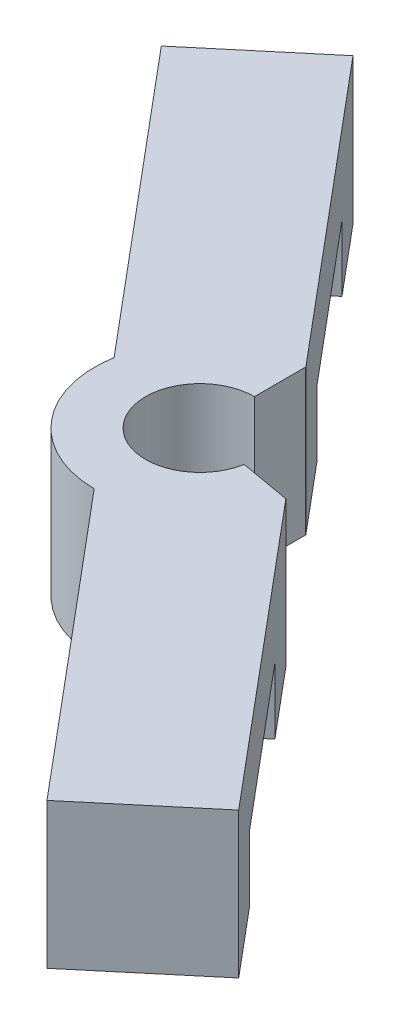
ISO-10303-21;
HEADER;
FILE_DESCRIPTION(('STEP AP214'),'2;1');
FILE_NAME('part.step','',(''),(''),'','','');
FILE_SCHEMA(('AUTOMOTIVE_DESIGN { 1 0 10303 214 1 1 1 1 }'));
ENDSEC;
DATA;
#1=APPLICATION_CONTEXT('core data for automotive mechanical design processes');
#2=APPLICATION_PROTOCOL_DEFINITION('international standard','automotive_design',2000,#1);
#3=PRODUCT_CONTEXT('',#1,'mechanical');
#4=PRODUCT('Part','Part','',(#3));
#5=PRODUCT_RELATED_PRODUCT_CATEGORY('part','',(#4));
#6=PRODUCT_DEFINITION_FORMATION('','',#4);
#7=PRODUCT_DEFINITION_CONTEXT('part definition',#1,'design');
#8=PRODUCT_DEFINITION('design','',#6,#7);
#9=PRODUCT_DEFINITION_SHAPE('','',#8);
#10=(LENGTH_UNIT() NAMED_UNIT(*) SI_UNIT(.MILLI.,.METRE.));
#11=(NAMED_UNIT(*) PLANE_ANGLE_UNIT() SI_UNIT($,.RADIAN.));
#12=(NAMED_UNIT(*) SI_UNIT($,.STERADIAN.) SOLID_ANGLE_UNIT());
#13=UNCERTAINTY_MEASURE_WITH_UNIT(LENGTH_MEASURE(1.E-05),#10,'distance_accuracy_value','');
#14=(GEOMETRIC_REPRESENTATION_CONTEXT(3) GLOBAL_UNCERTAINTY_ASSIGNED_CONTEXT((#13)) GLOBAL_UNIT_ASSIGNED_CONTEXT((#10,
#11,#12)) REPRESENTATION_CONTEXT('',''));
#15=CARTESIAN_POINT('',(0.,0.,0.));
#16=DIRECTION('',(0.,0.,1.));
#17=DIRECTION('',(1.,0.,0.));
#18=AXIS2_PLACEMENT_3D('',#15,#16,#17);
#19=CARTESIAN_POINT('',(0.,0.,0.));
#20=DIRECTION('',(0.,1.,0.));
#21=DIRECTION('',(0.,0.,1.));
#22=AXIS2_PLACEMENT_3D('',#19,#20,#21);
#23=PLANE('',#22);
#24=DIRECTION('',(-0.642787609686538,0.,-0.766044443118979));
#25=VECTOR('',#24,1.);
#26=CARTESIAN_POINT('',(3.06417777247595,0.,-2.57115043874618));
#27=LINE('',#26,#25);
#28=CARTESIAN_POINT('',(-11.0771496406279,0.,-19.4241281873637));
#29=VERTEX_POINT('',#28);
#30=CARTESIAN_POINT('',(-14.460084449623,0.,-23.4557528994956));
#31=VERTEX_POINT('',#30);
#32=EDGE_CURVE('E316',#29,#31,#27,.T.);
#33=ORIENTED_EDGE('',*,*,#32,.F.);
#34=DIRECTION('',(-0.766044443118979,0.,0.642787609686538));
#35=VECTOR('',#34,1.);
#36=CARTESIAN_POINT('',(-14.1413274131038,0.,-16.8529777486175));
#37=LINE('',#36,#35);
#38=CARTESIAN_POINT('',(-17.2055051855797,0.,-14.2818273098714));
#39=VERTEX_POINT('',#38);
#40=EDGE_CURVE('E11',#29,#39,#37,.T.);
#41=ORIENTED_EDGE('',*,*,#40,.T.);
#42=DIRECTION('',(-0.642787609686538,0.,-0.766044443118979));
#43=VECTOR('',#42,1.);
#44=CARTESIAN_POINT('',(-3.06417777247588,0.,2.57115043874612));
#45=LINE('',#44,#43);
#46=CARTESIAN_POINT('',(-20.5884399945748,0.,-18.3134520220033));
#47=VERTEX_POINT('',#46);
#48=EDGE_CURVE('E207',#39,#47,#45,.T.);
#49=ORIENTED_EDGE('',*,*,#48,.T.);
#50=DIRECTION('',(0.766044443118979,0.,-0.642787609686538));
#51=VECTOR('',#50,1.);
#52=CARTESIAN_POINT('',(-17.5242622220989,0.,-20.8846024607495));
#53=LINE('',#52,#51);
#54=EDGE_CURVE('E213',#47,#31,#53,.T.);
#55=ORIENTED_EDGE('',*,*,#54,.T.);
#56=EDGE_LOOP('',(#33,#41,#49,#55));
#57=FACE_BOUND('',#56,.T.);
#58=ADVANCED_FACE('F45',(#57),#23,.F.);
#59=DIRECTION('',(0.642787609686538,0.,0.766044443118979));
#60=VECTOR('',#59,1.);
#61=CARTESIAN_POINT('',(-3.06417777247588,0.,2.57115043874612));
#62=LINE('',#61,#60);
#63=CARTESIAN_POINT('',(11.077149640628,0.,19.4241281873637));
#64=VERTEX_POINT('',#63);
#65=CARTESIAN_POINT('',(14.460084449623,0.,23.4557528994956));
#66=VERTEX_POINT('',#65);
#67=EDGE_CURVE('E211',#64,#66,#62,.T.);
#68=ORIENTED_EDGE('',*,*,#67,.F.);
#69=DIRECTION('',(0.766044443118979,0.,-0.642787609686538));
#70=VECTOR('',#69,1.);
#71=CARTESIAN_POINT('',(14.1413274131038,0.,16.8529777486175));
#72=LINE('',#71,#70);
#73=CARTESIAN_POINT('',(17.2055051855798,0.,14.2818273098714));
#74=VERTEX_POINT('',#73);
#75=EDGE_CURVE('E191',#64,#74,#72,.T.);
#76=ORIENTED_EDGE('',*,*,#75,.T.);
#77=DIRECTION('',(0.642787609686538,0.,0.766044443118979));
#78=VECTOR('',#77,1.);
#79=CARTESIAN_POINT('',(3.06417777247595,0.,-2.57115043874618));
#80=LINE('',#79,#78);
#81=CARTESIAN_POINT('',(20.5884399945749,0.,18.3134520220033));
#82=VERTEX_POINT('',#81);
#83=EDGE_CURVE('E274',#74,#82,#80,.T.);
#84=ORIENTED_EDGE('',*,*,#83,.T.);
#85=DIRECTION('',(0.766044443118979,0.,-0.642787609686538));
#86=VECTOR('',#85,1.);
#87=CARTESIAN_POINT('',(17.5242622220989,0.,20.8846024607495));
#88=LINE('',#87,#86);
#89=EDGE_CURVE('E288',#66,#82,#88,.T.);
#90=ORIENTED_EDGE('',*,*,#89,.F.);
#91=EDGE_LOOP('',(#68,#76,#84,#90));
#92=FACE_BOUND('',#91,.T.);
#93=ADVANCED_FACE('F272',(#92),#23,.F.);
#94=CARTESIAN_POINT('',(17.5242622220989,8.55,20.8846024607495));
#95=DIRECTION('',(-0.642787609686538,0.,-0.766044443118979));
#96=DIRECTION('',(-0.76604444311898,0.,0.642787609686538));
#97=AXIS2_PLACEMENT_3D('',#94,#95,#96);
#98=PLANE('',#97);
#99=ORIENTED_EDGE('',*,*,#89,.T.);
#100=DIRECTION('',(0.,-1.,0.));
#101=VECTOR('',#100,1.);
#102=CARTESIAN_POINT('',(20.5884399945749,8.55,18.3134520220033));
#103=LINE('',#102,#101);
#104=CARTESIAN_POINT('',(20.5884399945749,8.55,18.3134520220033));
#105=VERTEX_POINT('',#104);
#106=EDGE_CURVE('E260',#105,#82,#103,.T.);
#107=ORIENTED_EDGE('',*,*,#106,.F.);
#108=DIRECTION('',(0.766044443118979,0.,-0.642787609686538));
#109=VECTOR('',#108,1.);
#110=CARTESIAN_POINT('',(17.5242622220989,8.55,20.8846024607495));
#111=LINE('',#110,#109);
#112=CARTESIAN_POINT('',(14.460084449623,8.55,23.4557528994956));
#113=VERTEX_POINT('',#112);
#114=EDGE_CURVE('E221',#113,#105,#111,.T.);
#115=ORIENTED_EDGE('',*,*,#114,.F.);
#116=DIRECTION('',(0.,-1.,0.));
#117=VECTOR('',#116,1.);
#118=CARTESIAN_POINT('',(14.460084449623,8.55,23.4557528994956));
#119=LINE('',#118,#117);
#120=EDGE_CURVE('E222',#113,#66,#119,.T.);
#121=ORIENTED_EDGE('',*,*,#120,.T.);
#122=EDGE_LOOP('',(#99,#107,#115,#121));
#123=FACE_BOUND('',#122,.T.);
#124=ADVANCED_FACE('F47',(#123),#98,.F.);
#125=CARTESIAN_POINT('',(3.06417777247595,8.55,-2.57115043874618));
#126=DIRECTION('',(0.766044443118979,0.,-0.642787609686538));
#127=DIRECTION('',(-0.642787609686538,0.,-0.766044443118979));
#128=AXIS2_PLACEMENT_3D('',#125,#126,#127);
#129=PLANE('',#128);
#130=DIRECTION('',(0.,-1.,0.));
#131=VECTOR('',#130,1.);
#132=CARTESIAN_POINT('',(17.2055051855798,8.55,14.2818273098714));
#133=LINE('',#132,#131);
#134=CARTESIAN_POINT('',(17.2055051855798,3.87239923594268,14.2818273098714));
#135=VERTEX_POINT('',#134);
#136=EDGE_CURVE('E282',#135,#74,#133,.T.);
#137=ORIENTED_EDGE('',*,*,#136,.F.);
#138=DIRECTION('',(0.642787609686538,0.,0.766044443118979));
#139=VECTOR('',#138,1.);
#140=CARTESIAN_POINT('',(3.06417777247595,3.87239923594268,-2.57115043874618));
#141=LINE('',#140,#139);
#142=CARTESIAN_POINT('',(9.49205386934132,3.87239923594268,5.08929399244361));
#143=VERTEX_POINT('',#142);
#144=EDGE_CURVE('E414',#143,#135,#141,.T.);
#145=ORIENTED_EDGE('',*,*,#144,.F.);
#146=DIRECTION('',(0.,1.,0.));
#147=VECTOR('',#146,1.);
#148=CARTESIAN_POINT('',(9.49205386934133,8.55,5.08929399244361));
#149=LINE('',#148,#147);
#150=CARTESIAN_POINT('',(9.49205386934133,0.,5.08929399244361));
#151=VERTEX_POINT('',#150);
#152=EDGE_CURVE('E413',#151,#143,#149,.T.);
#153=ORIENTED_EDGE('',*,*,#152,.F.);
#154=CARTESIAN_POINT('',(6.10911906034624,0.,1.05766928031169));
#155=VERTEX_POINT('',#154);
#156=EDGE_CURVE('E287',#155,#151,#80,.T.);
#157=ORIENTED_EDGE('',*,*,#156,.F.);
#158=DIRECTION('',(0.,-1.,0.));
#159=VECTOR('',#158,1.);
#160=CARTESIAN_POINT('',(6.10911906034624,8.55,1.05766928031169));
#161=LINE('',#160,#159);
#162=CARTESIAN_POINT('',(6.10911906034624,8.55,1.05766928031169));
#163=VERTEX_POINT('',#162);
#164=EDGE_CURVE('E257',#163,#155,#161,.T.);
#165=ORIENTED_EDGE('',*,*,#164,.F.);
#166=DIRECTION('',(0.642787609686538,0.,0.766044443118979));
#167=VECTOR('',#166,1.);
#168=CARTESIAN_POINT('',(3.06417777247595,8.55,-2.57115043874618));
#169=LINE('',#168,#167);
#170=EDGE_CURVE('E368',#163,#105,#169,.T.);
#171=ORIENTED_EDGE('',*,*,#170,.T.);
#172=ORIENTED_EDGE('',*,*,#106,.T.);
#173=ORIENTED_EDGE('',*,*,#83,.F.);
#174=EDGE_LOOP('',(#137,#145,#153,#157,#165,#171,#172,#173));
#175=FACE_BOUND('',#174,.T.);
#176=ADVANCED_FACE('F280',(#175),#129,.T.);
#177=CARTESIAN_POINT('',(0.,8.55,0.));
#178=DIRECTION('',(0.,-1.,0.));
#179=DIRECTION('',(0.,0.,-1.));
#180=AXIS2_PLACEMENT_3D('',#177,#178,#179);
#181=CYLINDRICAL_SURFACE('',#180,6.2);
#182=CARTESIAN_POINT('',(0.,0.,0.));
#183=DIRECTION('',(0.,1.,0.));
#184=DIRECTION('',(0.,0.,1.));
#185=AXIS2_PLACEMENT_3D('',#182,#183,#184);
#186=CIRCLE('',#185,6.2);
#187=CARTESIAN_POINT('',(6.10580806867569,0.,1.07661870153499));
#188=VERTEX_POINT('',#187);
#189=EDGE_CURVE('E293',#188,#155,#186,.T.);
#190=ORIENTED_EDGE('',*,*,#189,.F.);
#191=DIRECTION('',(0.,-1.,0.));
#192=VECTOR('',#191,1.);
#193=CARTESIAN_POINT('',(6.10580806867569,8.55,1.07661870153499));
#194=LINE('',#193,#192);
#195=CARTESIAN_POINT('',(6.10580806867569,8.55,1.07661870153499));
#196=VERTEX_POINT('',#195);
#197=EDGE_CURVE('E254',#196,#188,#194,.T.);
#198=ORIENTED_EDGE('',*,*,#197,.F.);
#199=CARTESIAN_POINT('',(0.,8.55,0.));
#200=DIRECTION('',(0.,1.,0.));
#201=DIRECTION('',(0.,0.,1.));
#202=AXIS2_PLACEMENT_3D('',#199,#200,#201);
#203=CIRCLE('',#202,6.2);
#204=EDGE_CURVE('E371',#196,#163,#203,.T.);
#205=ORIENTED_EDGE('',*,*,#204,.T.);
#206=ORIENTED_EDGE('',*,*,#164,.T.);
#207=EDGE_LOOP('',(#190,#198,#205,#206));
#208=FACE_BOUND('',#207,.T.);
#209=ADVANCED_FACE('F410',(#208),#181,.F.);
#210=CARTESIAN_POINT('',(0.,8.55,0.));
#211=DIRECTION('',(0.173648177666934,0.,-0.984807753012208));
#212=DIRECTION('',(-0.984807753012207,0.,-0.173648177666934));
#213=AXIS2_PLACEMENT_3D('',#210,#211,#212);
#214=PLANE('',#213);
#215=DIRECTION('',(0.984807753012208,0.,0.173648177666934));
#216=VECTOR('',#215,1.);
#217=CARTESIAN_POINT('',(0.,0.,0.));
#218=LINE('',#217,#216);
#219=CARTESIAN_POINT('',(3.15138480963906,0.,0.55567416853419));
#220=VERTEX_POINT('',#219);
#221=EDGE_CURVE('E301',#220,#188,#218,.T.);
#222=ORIENTED_EDGE('',*,*,#221,.F.);
#223=DIRECTION('',(0.,-1.,0.));
#224=VECTOR('',#223,1.);
#225=CARTESIAN_POINT('',(3.15138480963906,8.55,0.55567416853419));
#226=LINE('',#225,#224);
#227=CARTESIAN_POINT('',(3.15138480963906,8.55,0.55567416853419));
#228=VERTEX_POINT('',#227);
#229=EDGE_CURVE('E251',#228,#220,#226,.T.);
#230=ORIENTED_EDGE('',*,*,#229,.F.);
#231=DIRECTION('',(0.984807753012208,0.,0.173648177666934));
#232=VECTOR('',#231,1.);
#233=CARTESIAN_POINT('',(0.,8.55,0.));
#234=LINE('',#233,#232);
#235=EDGE_CURVE('E379',#228,#196,#234,.T.);
#236=ORIENTED_EDGE('',*,*,#235,.T.);
#237=ORIENTED_EDGE('',*,*,#197,.T.);
#238=EDGE_LOOP('',(#222,#230,#236,#237));
#239=FACE_BOUND('',#238,.T.);
#240=ADVANCED_FACE('F406',(#239),#214,.T.);
#241=CARTESIAN_POINT('',(0.,8.55,0.));
#242=DIRECTION('',(0.,-1.,0.));
#243=DIRECTION('',(0.,0.,-1.));
#244=AXIS2_PLACEMENT_3D('',#241,#242,#243);
#245=CYLINDRICAL_SURFACE('',#244,3.2);
#246=CARTESIAN_POINT('',(0.,0.,0.));
#247=DIRECTION('',(0.,1.,0.));
#248=DIRECTION('',(0.,0.,1.));
#249=AXIS2_PLACEMENT_3D('',#246,#247,#248);
#250=CIRCLE('',#249,3.2);
#251=CARTESIAN_POINT('',(0.,0.,-3.2));
#252=VERTEX_POINT('',#251);
#253=EDGE_CURVE('E305',#252,#220,#250,.T.);
#254=ORIENTED_EDGE('',*,*,#253,.F.);
#255=DIRECTION('',(0.,-1.,0.));
#256=VECTOR('',#255,1.);
#257=CARTESIAN_POINT('',(0.,8.55,-3.2));
#258=LINE('',#257,#256);
#259=CARTESIAN_POINT('',(0.,8.55,-3.2));
#260=VERTEX_POINT('',#259);
#261=EDGE_CURVE('E248',#260,#252,#258,.T.);
#262=ORIENTED_EDGE('',*,*,#261,.F.);
#263=CARTESIAN_POINT('',(0.,8.55,0.));
#264=DIRECTION('',(0.,1.,0.));
#265=DIRECTION('',(0.,0.,1.));
#266=AXIS2_PLACEMENT_3D('',#263,#264,#265);
#267=CIRCLE('',#266,3.2);
#268=EDGE_CURVE('E383',#260,#228,#267,.T.);
#269=ORIENTED_EDGE('',*,*,#268,.T.);
#270=ORIENTED_EDGE('',*,*,#229,.T.);
#271=EDGE_LOOP('',(#254,#262,#269,#270));
#272=FACE_BOUND('',#271,.T.);
#273=ADVANCED_FACE('F403',(#272),#245,.F.);
#274=CARTESIAN_POINT('',(0.,8.55,0.));
#275=DIRECTION('',(-1.,0.,0.));
#276=DIRECTION('',(0.,0.,1.));
#277=AXIS2_PLACEMENT_3D('',#274,#275,#276);
#278=PLANE('',#277);
#279=DIRECTION('',(0.,0.,-1.));
#280=VECTOR('',#279,1.);
#281=CARTESIAN_POINT('',(0.,0.,0.));
#282=LINE('',#281,#280);
#283=CARTESIAN_POINT('',(0.,0.,-6.2));
#284=VERTEX_POINT('',#283);
#285=EDGE_CURVE('E309',#252,#284,#282,.T.);
#286=ORIENTED_EDGE('',*,*,#285,.T.);
#287=DIRECTION('',(0.,-1.,0.));
#288=VECTOR('',#287,1.);
#289=CARTESIAN_POINT('',(0.,8.55,-6.2));
#290=LINE('',#289,#288);
#291=CARTESIAN_POINT('',(0.,8.55,-6.2));
#292=VERTEX_POINT('',#291);
#293=EDGE_CURVE('E245',#292,#284,#290,.T.);
#294=ORIENTED_EDGE('',*,*,#293,.F.);
#295=DIRECTION('',(0.,0.,-1.));
#296=VECTOR('',#295,1.);
#297=CARTESIAN_POINT('',(0.,8.55,0.));
#298=LINE('',#297,#296);
#299=EDGE_CURVE('E387',#260,#292,#298,.T.);
#300=ORIENTED_EDGE('',*,*,#299,.F.);
#301=ORIENTED_EDGE('',*,*,#261,.T.);
#302=EDGE_LOOP('',(#286,#294,#300,#301));
#303=FACE_BOUND('',#302,.T.);
#304=ADVANCED_FACE('F399',(#303),#278,.F.);
#305=CARTESIAN_POINT('',(0.,8.55,0.));
#306=DIRECTION('',(0.,-1.,0.));
#307=DIRECTION('',(0.,0.,-1.));
#308=AXIS2_PLACEMENT_3D('',#305,#306,#307);
#309=CYLINDRICAL_SURFACE('',#308,6.2);
#310=CARTESIAN_POINT('',(0.,0.,0.));
#311=DIRECTION('',(0.,1.,0.));
#312=DIRECTION('',(0.,0.,1.));
#313=AXIS2_PLACEMENT_3D('',#310,#311,#312);
#314=CIRCLE('',#313,6.2);
#315=CARTESIAN_POINT('',(0.0192364846056626,0.,-6.19997015780405));
#316=VERTEX_POINT('',#315);
#317=EDGE_CURVE('E313',#316,#284,#314,.T.);
#318=ORIENTED_EDGE('',*,*,#317,.F.);
#319=DIRECTION('',(0.,-1.,0.));
#320=VECTOR('',#319,1.);
#321=CARTESIAN_POINT('',(0.0192364846056626,8.55,-6.19997015780405));
#322=LINE('',#321,#320);
#323=CARTESIAN_POINT('',(0.0192364846056626,8.55,-6.19997015780405));
#324=VERTEX_POINT('',#323);
#325=EDGE_CURVE('E242',#324,#316,#322,.T.);
#326=ORIENTED_EDGE('',*,*,#325,.F.);
#327=CARTESIAN_POINT('',(0.,8.55,0.));
#328=DIRECTION('',(0.,1.,0.));
#329=DIRECTION('',(0.,0.,1.));
#330=AXIS2_PLACEMENT_3D('',#327,#328,#329);
#331=CIRCLE('',#330,6.2);
#332=EDGE_CURVE('E351',#324,#292,#331,.T.);
#333=ORIENTED_EDGE('',*,*,#332,.T.);
#334=ORIENTED_EDGE('',*,*,#293,.T.);
#335=EDGE_LOOP('',(#318,#326,#333,#334));
#336=FACE_BOUND('',#335,.T.);
#337=ADVANCED_FACE('F393',(#336),#309,.F.);
#338=CARTESIAN_POINT('',(3.06417777247595,8.55,-2.57115043874618));
#339=DIRECTION('',(-0.766044443118979,0.,0.642787609686538));
#340=DIRECTION('',(0.642787609686538,0.,0.766044443118979));
#341=AXIS2_PLACEMENT_3D('',#338,#339,#340);
#342=PLANE('',#341);
#343=DIRECTION('',(-0.642787609686538,0.,-0.766044443118979));
#344=VECTOR('',#343,1.);
#345=CARTESIAN_POINT('',(3.06417777247595,3.87239923594268,-2.57115043874618));
#346=LINE('',#345,#344);
#347=CARTESIAN_POINT('',(-3.36369832438943,3.87239923594268,-10.231594869936));
#348=VERTEX_POINT('',#347);
#349=CARTESIAN_POINT('',(-11.0771496406279,3.87239923594268,-19.4241281873637));
#350=VERTEX_POINT('',#349);
#351=EDGE_CURVE('E294',#348,#350,#346,.T.);
#352=ORIENTED_EDGE('',*,*,#351,.T.);
#353=DIRECTION('',(0.,-1.,0.));
#354=VECTOR('',#353,1.);
#355=CARTESIAN_POINT('',(-11.0771496406279,8.55,-19.4241281873637));
#356=LINE('',#355,#354);
#357=EDGE_CURVE('E330',#350,#29,#356,.T.);
#358=ORIENTED_EDGE('',*,*,#357,.T.);
#359=ORIENTED_EDGE('',*,*,#32,.T.);
#360=DIRECTION('',(0.,-1.,0.));
#361=VECTOR('',#360,1.);
#362=CARTESIAN_POINT('',(-14.460084449623,8.55,-23.4557528994956));
#363=LINE('',#362,#361);
#364=CARTESIAN_POINT('',(-14.460084449623,8.55,-23.4557528994956));
#365=VERTEX_POINT('',#364);
#366=EDGE_CURVE('E238',#365,#31,#363,.T.);
#367=ORIENTED_EDGE('',*,*,#366,.F.);
#368=DIRECTION('',(-0.642787609686538,0.,-0.766044443118979));
#369=VECTOR('',#368,1.);
#370=CARTESIAN_POINT('',(3.06417777247595,8.55,-2.57115043874618));
#371=LINE('',#370,#369);
#372=EDGE_CURVE('E344',#324,#365,#371,.T.);
#373=ORIENTED_EDGE('',*,*,#372,.F.);
#374=ORIENTED_EDGE('',*,*,#325,.T.);
#375=CARTESIAN_POINT('',(-3.36369832438943,0.,-10.231594869936));
#376=VERTEX_POINT('',#375);
#377=EDGE_CURVE('E317',#316,#376,#27,.T.);
#378=ORIENTED_EDGE('',*,*,#377,.T.);
#379=DIRECTION('',(0.,1.,0.));
#380=VECTOR('',#379,1.);
#381=CARTESIAN_POINT('',(-3.36369832438943,8.55,-10.231594869936));
#382=LINE('',#381,#380);
#383=EDGE_CURVE('E61',#376,#348,#382,.T.);
#384=ORIENTED_EDGE('',*,*,#383,.T.);
#385=EDGE_LOOP('',(#352,#358,#359,#367,#373,#374,#378,#384));
#386=FACE_BOUND('',#385,.T.);
#387=ADVANCED_FACE('F327',(#386),#342,.F.);
#388=CARTESIAN_POINT('',(-17.5242622220989,8.55,-20.8846024607495));
#389=DIRECTION('',(-0.642787609686538,0.,-0.766044443118979));
#390=DIRECTION('',(-0.766044443118979,0.,0.642787609686538));
#391=AXIS2_PLACEMENT_3D('',#388,#389,#390);
#392=PLANE('',#391);
#393=ORIENTED_EDGE('',*,*,#54,.F.);
#394=DIRECTION('',(0.,-1.,0.));
#395=VECTOR('',#394,1.);
#396=CARTESIAN_POINT('',(-20.5884399945748,8.55,-18.3134520220033));
#397=LINE('',#396,#395);
#398=CARTESIAN_POINT('',(-20.5884399945748,8.55,-18.3134520220033));
#399=VERTEX_POINT('',#398);
#400=EDGE_CURVE('E234',#399,#47,#397,.T.);
#401=ORIENTED_EDGE('',*,*,#400,.F.);
#402=DIRECTION('',(0.766044443118979,0.,-0.642787609686538));
#403=VECTOR('',#402,1.);
#404=CARTESIAN_POINT('',(-17.5242622220989,8.55,-20.8846024607495));
#405=LINE('',#404,#403);
#406=EDGE_CURVE('E336',#399,#365,#405,.T.);
#407=ORIENTED_EDGE('',*,*,#406,.T.);
#408=ORIENTED_EDGE('',*,*,#366,.T.);
#409=EDGE_LOOP('',(#393,#401,#407,#408));
#410=FACE_BOUND('',#409,.T.);
#411=ADVANCED_FACE('F334',(#410),#392,.T.);
#412=CARTESIAN_POINT('',(-3.06417777247588,8.55,2.57115043874612));
#413=DIRECTION('',(-0.766044443118979,0.,0.642787609686538));
#414=DIRECTION('',(0.642787609686538,0.,0.766044443118979));
#415=AXIS2_PLACEMENT_3D('',#412,#413,#414);
#416=PLANE('',#415);
#417=DIRECTION('',(0.,-1.,0.));
#418=VECTOR('',#417,1.);
#419=CARTESIAN_POINT('',(-17.2055051855797,0.,-14.2818273098714));
#420=LINE('',#419,#418);
#421=CARTESIAN_POINT('',(-17.2055051855797,3.87239923594268,-14.2818273098714));
#422=VERTEX_POINT('',#421);
#423=EDGE_CURVE('E438',#422,#39,#420,.T.);
#424=ORIENTED_EDGE('',*,*,#423,.F.);
#425=DIRECTION('',(-0.642787609686538,0.,-0.766044443118979));
#426=VECTOR('',#425,1.);
#427=CARTESIAN_POINT('',(-17.2055051855797,3.87239923594268,-14.2818273098714));
#428=LINE('',#427,#426);
#429=CARTESIAN_POINT('',(-9.49205386934126,3.87239923594268,-5.08929399244367));
#430=VERTEX_POINT('',#429);
#431=EDGE_CURVE('E198',#430,#422,#428,.T.);
#432=ORIENTED_EDGE('',*,*,#431,.F.);
#433=DIRECTION('',(0.,1.,0.));
#434=VECTOR('',#433,1.);
#435=CARTESIAN_POINT('',(-9.49205386934126,3.87239923594268,-5.08929399244367));
#436=LINE('',#435,#434);
#437=CARTESIAN_POINT('',(-9.49205386934126,0.,-5.08929399244367));
#438=VERTEX_POINT('',#437);
#439=EDGE_CURVE('E184',#438,#430,#436,.T.);
#440=ORIENTED_EDGE('',*,*,#439,.F.);
#441=CARTESIAN_POINT('',(-6.10911906034617,0.,-1.05766928031175));
#442=VERTEX_POINT('',#441);
#443=EDGE_CURVE('E196',#442,#438,#45,.T.);
#444=ORIENTED_EDGE('',*,*,#443,.F.);
#445=DIRECTION('',(0.,-1.,0.));
#446=VECTOR('',#445,1.);
#447=CARTESIAN_POINT('',(-6.10911906034617,8.55,-1.05766928031175));
#448=LINE('',#447,#446);
#449=CARTESIAN_POINT('',(-6.10911906034617,8.55,-1.05766928031175));
#450=VERTEX_POINT('',#449);
#451=EDGE_CURVE('E231',#450,#442,#448,.T.);
#452=ORIENTED_EDGE('',*,*,#451,.F.);
#453=DIRECTION('',(-0.642787609686538,0.,-0.766044443118979));
#454=VECTOR('',#453,1.);
#455=CARTESIAN_POINT('',(-3.06417777247588,8.55,2.57115043874612));
#456=LINE('',#455,#454);
#457=EDGE_CURVE('E340',#450,#399,#456,.T.);
#458=ORIENTED_EDGE('',*,*,#457,.T.);
#459=ORIENTED_EDGE('',*,*,#400,.T.);
#460=ORIENTED_EDGE('',*,*,#48,.F.);
#461=EDGE_LOOP('',(#424,#432,#440,#444,#452,#458,#459,#460));
#462=FACE_BOUND('',#461,.T.);
#463=ADVANCED_FACE('F195',(#462),#416,.T.);
#464=CARTESIAN_POINT('',(0.,8.55,0.));
#465=DIRECTION('',(0.,-1.,0.));
#466=DIRECTION('',(0.,0.,-1.));
#467=AXIS2_PLACEMENT_3D('',#464,#465,#466);
#468=CYLINDRICAL_SURFACE('',#467,6.2);
#469=CARTESIAN_POINT('',(0.,0.,0.));
#470=DIRECTION('',(0.,1.,0.));
#471=DIRECTION('',(0.,0.,1.));
#472=AXIS2_PLACEMENT_3D('',#469,#470,#471);
#473=CIRCLE('',#472,6.2);
#474=CARTESIAN_POINT('',(-0.0192364846055906,0.,6.19997015780399));
#475=VERTEX_POINT('',#474);
#476=EDGE_CURVE('E205',#442,#475,#473,.T.);
#477=ORIENTED_EDGE('',*,*,#476,.T.);
#478=DIRECTION('',(0.,-1.,0.));
#479=VECTOR('',#478,1.);
#480=CARTESIAN_POINT('',(-0.0192364846055906,8.55,6.19997015780399));
#481=LINE('',#480,#479);
#482=CARTESIAN_POINT('',(-0.0192364846055906,8.55,6.19997015780399));
#483=VERTEX_POINT('',#482);
#484=EDGE_CURVE('E226',#483,#475,#481,.T.);
#485=ORIENTED_EDGE('',*,*,#484,.F.);
#486=CARTESIAN_POINT('',(0.,8.55,0.));
#487=DIRECTION('',(0.,1.,0.));
#488=DIRECTION('',(0.,0.,1.));
#489=AXIS2_PLACEMENT_3D('',#486,#487,#488);
#490=CIRCLE('',#489,6.2);
#491=EDGE_CURVE('E349',#450,#483,#490,.T.);
#492=ORIENTED_EDGE('',*,*,#491,.F.);
#493=ORIENTED_EDGE('',*,*,#451,.T.);
#494=EDGE_LOOP('',(#477,#485,#492,#493));
#495=FACE_BOUND('',#494,.T.);
#496=ADVANCED_FACE('F482',(#495),#468,.T.);
#497=CARTESIAN_POINT('',(-3.06417777247588,8.55,2.57115043874612));
#498=DIRECTION('',(0.766044443118979,0.,-0.642787609686538));
#499=DIRECTION('',(-0.642787609686538,0.,-0.766044443118979));
#500=AXIS2_PLACEMENT_3D('',#497,#498,#499);
#501=PLANE('',#500);
#502=DIRECTION('',(-0.642787609686538,0.,-0.766044443118979));
#503=VECTOR('',#502,1.);
#504=CARTESIAN_POINT('',(11.077149640628,3.87239923594268,19.4241281873637));
#505=LINE('',#504,#503);
#506=CARTESIAN_POINT('',(11.077149640628,3.87239923594268,19.4241281873637));
#507=VERTEX_POINT('',#506);
#508=CARTESIAN_POINT('',(3.3636983243895,3.87239923594268,10.2315948699359));
#509=VERTEX_POINT('',#508);
#510=EDGE_CURVE('E200',#507,#509,#505,.T.);
#511=ORIENTED_EDGE('',*,*,#510,.F.);
#512=DIRECTION('',(0.,1.,0.));
#513=VECTOR('',#512,1.);
#514=CARTESIAN_POINT('',(11.077149640628,0.,19.4241281873637));
#515=LINE('',#514,#513);
#516=EDGE_CURVE('E446',#64,#507,#515,.T.);
#517=ORIENTED_EDGE('',*,*,#516,.F.);
#518=ORIENTED_EDGE('',*,*,#67,.T.);
#519=ORIENTED_EDGE('',*,*,#120,.F.);
#520=DIRECTION('',(0.642787609686538,0.,0.766044443118979));
#521=VECTOR('',#520,1.);
#522=CARTESIAN_POINT('',(-3.06417777247588,8.55,2.57115043874612));
#523=LINE('',#522,#521);
#524=EDGE_CURVE('E227',#483,#113,#523,.T.);
#525=ORIENTED_EDGE('',*,*,#524,.F.);
#526=ORIENTED_EDGE('',*,*,#484,.T.);
#527=CARTESIAN_POINT('',(3.3636983243895,0.,10.2315948699359));
#528=VERTEX_POINT('',#527);
#529=EDGE_CURVE('E217',#475,#528,#62,.T.);
#530=ORIENTED_EDGE('',*,*,#529,.T.);
#531=DIRECTION('',(0.,-1.,0.));
#532=VECTOR('',#531,1.);
#533=CARTESIAN_POINT('',(3.3636983243895,3.87239923594268,10.2315948699359));
#534=LINE('',#533,#532);
#535=EDGE_CURVE('E69',#509,#528,#534,.T.);
#536=ORIENTED_EDGE('',*,*,#535,.F.);
#537=EDGE_LOOP('',(#511,#517,#518,#519,#525,#526,#530,#536));
#538=FACE_BOUND('',#537,.T.);
#539=ADVANCED_FACE('F365',(#538),#501,.F.);
#540=CARTESIAN_POINT('',(0.,8.55,0.));
#541=DIRECTION('',(0.,1.,0.));
#542=DIRECTION('',(0.,0.,1.));
#543=AXIS2_PLACEMENT_3D('',#540,#541,#542);
#544=PLANE('',#543);
#545=ORIENTED_EDGE('',*,*,#114,.T.);
#546=ORIENTED_EDGE('',*,*,#170,.F.);
#547=ORIENTED_EDGE('',*,*,#204,.F.);
#548=ORIENTED_EDGE('',*,*,#235,.F.);
#549=ORIENTED_EDGE('',*,*,#268,.F.);
#550=ORIENTED_EDGE('',*,*,#299,.T.);
#551=ORIENTED_EDGE('',*,*,#332,.F.);
#552=ORIENTED_EDGE('',*,*,#372,.T.);
#553=ORIENTED_EDGE('',*,*,#406,.F.);
#554=ORIENTED_EDGE('',*,*,#457,.F.);
#555=ORIENTED_EDGE('',*,*,#491,.T.);
#556=ORIENTED_EDGE('',*,*,#524,.T.);
#557=EDGE_LOOP('',(#545,#546,#547,#548,#549,#550,#551,#552,#553,#554,#555,#556));
#558=FACE_BOUND('',#557,.T.);
#559=ADVANCED_FACE('F342',(#558),#544,.T.);
#560=ORIENTED_EDGE('',*,*,#443,.T.);
#561=DIRECTION('',(0.766044443118979,0.,-0.642787609686538));
#562=VECTOR('',#561,1.);
#563=CARTESIAN_POINT('',(-6.42787609686538,0.,-7.66044443118979));
#564=LINE('',#563,#562);
#565=EDGE_CURVE('E54',#438,#376,#564,.T.);
#566=ORIENTED_EDGE('',*,*,#565,.T.);
#567=ORIENTED_EDGE('',*,*,#377,.F.);
#568=ORIENTED_EDGE('',*,*,#317,.T.);
#569=ORIENTED_EDGE('',*,*,#285,.F.);
#570=ORIENTED_EDGE('',*,*,#253,.T.);
#571=ORIENTED_EDGE('',*,*,#221,.T.);
#572=ORIENTED_EDGE('',*,*,#189,.T.);
#573=ORIENTED_EDGE('',*,*,#156,.T.);
#574=DIRECTION('',(-0.766044443118979,0.,0.642787609686538));
#575=VECTOR('',#574,1.);
#576=CARTESIAN_POINT('',(6.42787609686538,0.,7.66044443118979));
#577=LINE('',#576,#575);
#578=EDGE_CURVE('E264',#151,#528,#577,.T.);
#579=ORIENTED_EDGE('',*,*,#578,.T.);
#580=ORIENTED_EDGE('',*,*,#529,.F.);
#581=ORIENTED_EDGE('',*,*,#476,.F.);
#582=EDGE_LOOP('',(#560,#566,#567,#568,#569,#570,#571,#572,#573,#579,#580,#581));
#583=FACE_BOUND('',#582,.T.);
#584=ADVANCED_FACE('F203',(#583),#23,.F.);
#585=CARTESIAN_POINT('',(18.7375940718177,3.87239923594268,12.9962520904983));
#586=DIRECTION('',(0.,1.,0.));
#587=DIRECTION('',(0.,0.,1.));
#588=AXIS2_PLACEMENT_3D('',#585,#586,#587);
#589=PLANE('',#588);
#590=ORIENTED_EDGE('',*,*,#144,.T.);
#591=DIRECTION('',(-0.766044443118979,0.,0.642787609686538));
#592=VECTOR('',#591,1.);
#593=CARTESIAN_POINT('',(18.7375940718177,3.87239923594268,12.9962520904983));
#594=LINE('',#593,#592);
#595=EDGE_CURVE('E447',#135,#507,#594,.T.);
#596=ORIENTED_EDGE('',*,*,#595,.T.);
#597=ORIENTED_EDGE('',*,*,#510,.T.);
#598=DIRECTION('',(-0.766044443118979,0.,0.642787609686538));
#599=VECTOR('',#598,1.);
#600=CARTESIAN_POINT('',(11.0241427555793,3.87239923594268,3.80371877307053));
#601=LINE('',#600,#599);
#602=EDGE_CURVE('E443',#143,#509,#601,.T.);
#603=ORIENTED_EDGE('',*,*,#602,.F.);
#604=EDGE_LOOP('',(#590,#596,#597,#603));
#605=FACE_BOUND('',#604,.T.);
#606=ADVANCED_FACE('F454',(#605),#589,.F.);
#607=CARTESIAN_POINT('',(18.7375940718177,0.,12.9962520904983));
#608=DIRECTION('',(0.642787609686538,0.,0.766044443118979));
#609=DIRECTION('',(0.766044443118979,0.,-0.642787609686538));
#610=AXIS2_PLACEMENT_3D('',#607,#608,#609);
#611=PLANE('',#610);
#612=ORIENTED_EDGE('',*,*,#136,.T.);
#613=ORIENTED_EDGE('',*,*,#75,.F.);
#614=ORIENTED_EDGE('',*,*,#516,.T.);
#615=ORIENTED_EDGE('',*,*,#595,.F.);
#616=EDGE_LOOP('',(#612,#613,#614,#615));
#617=FACE_BOUND('',#616,.T.);
#618=ADVANCED_FACE('F457',(#617),#611,.F.);
#619=CARTESIAN_POINT('',(11.0241427555793,3.87239923594268,3.80371877307053));
#620=DIRECTION('',(-0.642787609686538,0.,-0.766044443118979));
#621=DIRECTION('',(-0.766044443118979,0.,0.642787609686538));
#622=AXIS2_PLACEMENT_3D('',#619,#620,#621);
#623=PLANE('',#622);
#624=ORIENTED_EDGE('',*,*,#152,.T.);
#625=ORIENTED_EDGE('',*,*,#602,.T.);
#626=ORIENTED_EDGE('',*,*,#535,.T.);
#627=ORIENTED_EDGE('',*,*,#578,.F.);
#628=EDGE_LOOP('',(#624,#625,#626,#627));
#629=FACE_BOUND('',#628,.T.);
#630=ADVANCED_FACE('F455',(#629),#623,.F.);
#631=CARTESIAN_POINT('',(-9.54506075438992,3.87239923594268,-20.7097034067368));
#632=DIRECTION('',(0.,1.,0.));
#633=DIRECTION('',(0.,0.,1.));
#634=AXIS2_PLACEMENT_3D('',#631,#632,#633);
#635=PLANE('',#634);
#636=DIRECTION('',(-0.766044443118979,0.,0.642787609686538));
#637=VECTOR('',#636,1.);
#638=CARTESIAN_POINT('',(-1.83160943815146,3.87239923594268,-11.517170089309));
#639=LINE('',#638,#637);
#640=EDGE_CURVE('E422',#348,#430,#639,.T.);
#641=ORIENTED_EDGE('',*,*,#640,.T.);
#642=ORIENTED_EDGE('',*,*,#431,.T.);
#643=DIRECTION('',(-0.766044443118979,0.,0.642787609686538));
#644=VECTOR('',#643,1.);
#645=CARTESIAN_POINT('',(-9.54506075438992,3.87239923594268,-20.7097034067368));
#646=LINE('',#645,#644);
#647=EDGE_CURVE('E417',#350,#422,#646,.T.);
#648=ORIENTED_EDGE('',*,*,#647,.F.);
#649=ORIENTED_EDGE('',*,*,#351,.F.);
#650=EDGE_LOOP('',(#641,#642,#648,#649));
#651=FACE_BOUND('',#650,.T.);
#652=ADVANCED_FACE('F436',(#651),#635,.F.);
#653=CARTESIAN_POINT('',(-9.54506075438992,0.,-20.7097034067368));
#654=DIRECTION('',(-0.642787609686538,0.,-0.766044443118979));
#655=DIRECTION('',(-0.766044443118979,0.,0.642787609686538));
#656=AXIS2_PLACEMENT_3D('',#653,#654,#655);
#657=PLANE('',#656);
#658=ORIENTED_EDGE('',*,*,#647,.T.);
#659=ORIENTED_EDGE('',*,*,#423,.T.);
#660=ORIENTED_EDGE('',*,*,#40,.F.);
#661=ORIENTED_EDGE('',*,*,#357,.F.);
#662=EDGE_LOOP('',(#658,#659,#660,#661));
#663=FACE_BOUND('',#662,.T.);
#664=ADVANCED_FACE('F463',(#663),#657,.F.);
#665=CARTESIAN_POINT('',(-1.83160943815146,3.87239923594268,-11.517170089309));
#666=DIRECTION('',(0.642787609686538,0.,0.766044443118979));
#667=DIRECTION('',(0.766044443118979,0.,-0.642787609686538));
#668=AXIS2_PLACEMENT_3D('',#665,#666,#667);
#669=PLANE('',#668);
#670=ORIENTED_EDGE('',*,*,#565,.F.);
#671=ORIENTED_EDGE('',*,*,#439,.T.);
#672=ORIENTED_EDGE('',*,*,#640,.F.);
#673=ORIENTED_EDGE('',*,*,#383,.F.);
#674=EDGE_LOOP('',(#670,#671,#672,#673));
#675=FACE_BOUND('',#674,.T.);
#676=ADVANCED_FACE('F183',(#675),#669,.F.);
#677=CLOSED_SHELL('',(#58,#93,#124,#176,#209,#240,#273,#304,#337,#387,#411,#463,#496,#539,#559,
#584,#606,#618,#630,#652,#664,#676));
#678=MANIFOLD_SOLID_BREP('B2',#677);
#679=ADVANCED_BREP_SHAPE_REPRESENTATION('',(#18,#678),#14);
#680=SHAPE_DEFINITION_REPRESENTATION(#9,#679);
ENDSEC;
END-ISO-10303-21;
